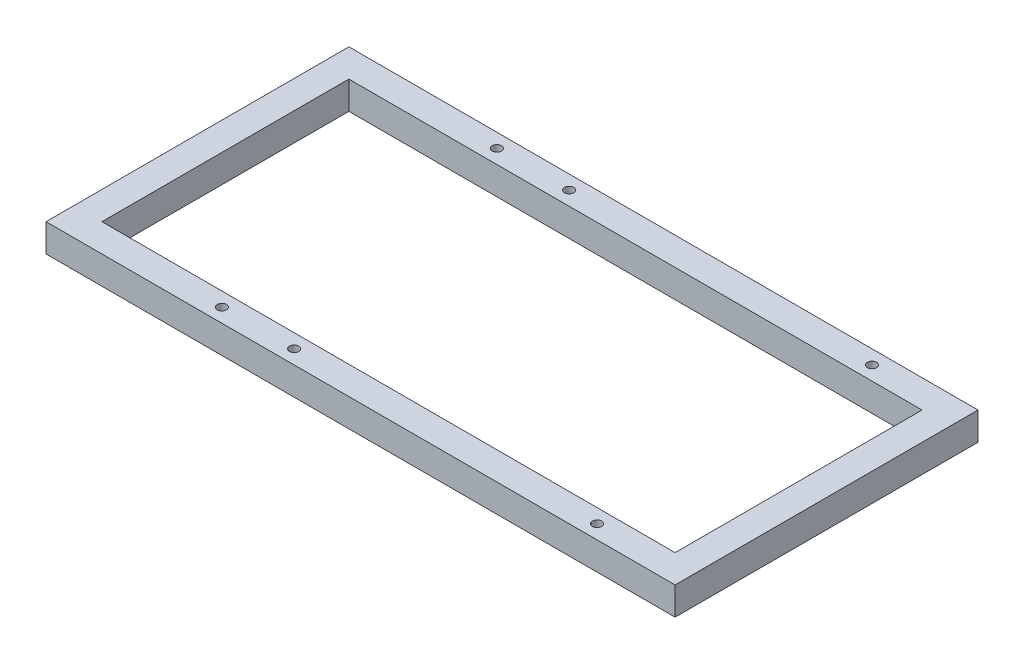
ISO-10303-21;
HEADER;
FILE_DESCRIPTION(('STEP AP214'),'2;1');
FILE_NAME('part.step','',(''),(''),'','','');
FILE_SCHEMA(('AUTOMOTIVE_DESIGN { 1 0 10303 214 1 1 1 1 }'));
ENDSEC;
DATA;
#1=APPLICATION_CONTEXT('core data for automotive mechanical design processes');
#2=APPLICATION_PROTOCOL_DEFINITION('international standard','automotive_design',2000,#1);
#3=PRODUCT_CONTEXT('',#1,'mechanical');
#4=PRODUCT('Part','Part','',(#3));
#5=PRODUCT_RELATED_PRODUCT_CATEGORY('part','',(#4));
#6=PRODUCT_DEFINITION_FORMATION('','',#4);
#7=PRODUCT_DEFINITION_CONTEXT('part definition',#1,'design');
#8=PRODUCT_DEFINITION('design','',#6,#7);
#9=PRODUCT_DEFINITION_SHAPE('','',#8);
#10=(LENGTH_UNIT() NAMED_UNIT(*) SI_UNIT(.MILLI.,.METRE.));
#11=(NAMED_UNIT(*) PLANE_ANGLE_UNIT() SI_UNIT($,.RADIAN.));
#12=(NAMED_UNIT(*) SI_UNIT($,.STERADIAN.) SOLID_ANGLE_UNIT());
#13=UNCERTAINTY_MEASURE_WITH_UNIT(LENGTH_MEASURE(1.E-05),#10,'distance_accuracy_value','');
#14=(GEOMETRIC_REPRESENTATION_CONTEXT(3) GLOBAL_UNCERTAINTY_ASSIGNED_CONTEXT((#13)) GLOBAL_UNIT_ASSIGNED_CONTEXT((#10,
#11,#12)) REPRESENTATION_CONTEXT('',''));
#15=CARTESIAN_POINT('',(0.,0.,0.));
#16=DIRECTION('',(0.,0.,1.));
#17=DIRECTION('',(1.,0.,0.));
#18=AXIS2_PLACEMENT_3D('',#15,#16,#17);
#19=CARTESIAN_POINT('',(0.,12.,0.));
#20=DIRECTION('',(0.,1.,0.));
#21=DIRECTION('',(0.,0.,1.));
#22=AXIS2_PLACEMENT_3D('',#19,#20,#21);
#23=PLANE('',#22);
#24=CARTESIAN_POINT('',(95.4999999999999,12.,-59.));
#25=DIRECTION('',(0.,-1.,0.));
#26=DIRECTION('',(0.,0.,-1.));
#27=AXIS2_PLACEMENT_3D('',#24,#25,#26);
#28=CIRCLE('',#27,2.);
#29=CARTESIAN_POINT('',(95.4999999999999,12.,-61.));
#30=VERTEX_POINT('',#29);
#31=EDGE_CURVE('E195',#30,#30,#28,.T.);
#32=ORIENTED_EDGE('',*,*,#31,.T.);
#33=EDGE_LOOP('',(#32));
#34=FACE_BOUND('',#33,.T.);
#35=CARTESIAN_POINT('',(95.4999999999999,12.,59.));
#36=DIRECTION('',(0.,1.,0.));
#37=DIRECTION('',(0.,0.,1.));
#38=AXIS2_PLACEMENT_3D('',#35,#36,#37);
#39=CIRCLE('',#38,2.);
#40=CARTESIAN_POINT('',(95.4999999999999,12.,61.));
#41=VERTEX_POINT('',#40);
#42=EDGE_CURVE('E185',#41,#41,#39,.T.);
#43=ORIENTED_EDGE('',*,*,#42,.F.);
#44=EDGE_LOOP('',(#43));
#45=FACE_BOUND('',#44,.T.);
#46=CARTESIAN_POINT('',(-34.5000000000001,12.,59.));
#47=DIRECTION('',(0.,1.,0.));
#48=DIRECTION('',(0.,0.,1.));
#49=AXIS2_PLACEMENT_3D('',#46,#47,#48);
#50=CIRCLE('',#49,2.);
#51=CARTESIAN_POINT('',(-34.5000000000001,12.,61.));
#52=VERTEX_POINT('',#51);
#53=EDGE_CURVE('E182',#52,#52,#50,.T.);
#54=ORIENTED_EDGE('',*,*,#53,.F.);
#55=EDGE_LOOP('',(#54));
#56=FACE_BOUND('',#55,.T.);
#57=CARTESIAN_POINT('',(-34.5000000000001,12.,-59.));
#58=DIRECTION('',(0.,-1.,0.));
#59=DIRECTION('',(0.,0.,-1.));
#60=AXIS2_PLACEMENT_3D('',#57,#58,#59);
#61=CIRCLE('',#60,2.);
#62=CARTESIAN_POINT('',(-34.5000000000001,12.,-61.));
#63=VERTEX_POINT('',#62);
#64=EDGE_CURVE('E179',#63,#63,#61,.T.);
#65=ORIENTED_EDGE('',*,*,#64,.T.);
#66=EDGE_LOOP('',(#65));
#67=FACE_BOUND('',#66,.T.);
#68=CARTESIAN_POINT('',(-65.5000000000001,12.,-59.));
#69=DIRECTION('',(0.,-1.,0.));
#70=DIRECTION('',(0.,0.,-1.));
#71=AXIS2_PLACEMENT_3D('',#68,#69,#70);
#72=CIRCLE('',#71,2.);
#73=CARTESIAN_POINT('',(-65.5000000000001,12.,-61.));
#74=VERTEX_POINT('',#73);
#75=EDGE_CURVE('E175',#74,#74,#72,.T.);
#76=ORIENTED_EDGE('',*,*,#75,.T.);
#77=EDGE_LOOP('',(#76));
#78=FACE_BOUND('',#77,.T.);
#79=CARTESIAN_POINT('',(-65.5000000000001,12.,59.));
#80=DIRECTION('',(0.,1.,0.));
#81=DIRECTION('',(0.,0.,1.));
#82=AXIS2_PLACEMENT_3D('',#79,#80,#81);
#83=CIRCLE('',#82,2.);
#84=CARTESIAN_POINT('',(-65.5000000000001,12.,61.));
#85=VERTEX_POINT('',#84);
#86=EDGE_CURVE('E171',#85,#85,#83,.T.);
#87=ORIENTED_EDGE('',*,*,#86,.F.);
#88=EDGE_LOOP('',(#87));
#89=FACE_BOUND('',#88,.T.);
#90=DIRECTION('',(0.,0.,-1.));
#91=VECTOR('',#90,1.);
#92=CARTESIAN_POINT('',(135.,12.,-65.));
#93=LINE('',#92,#91);
#94=CARTESIAN_POINT('',(135.,12.,65.));
#95=VERTEX_POINT('',#94);
#96=CARTESIAN_POINT('',(135.,12.,-65.));
#97=VERTEX_POINT('',#96);
#98=EDGE_CURVE('E144',#95,#97,#93,.T.);
#99=ORIENTED_EDGE('',*,*,#98,.T.);
#100=DIRECTION('',(-1.,0.,0.));
#101=VECTOR('',#100,1.);
#102=CARTESIAN_POINT('',(-135.,12.,-65.));
#103=LINE('',#102,#101);
#104=CARTESIAN_POINT('',(-135.,12.,-65.));
#105=VERTEX_POINT('',#104);
#106=EDGE_CURVE('E147',#97,#105,#103,.T.);
#107=ORIENTED_EDGE('',*,*,#106,.T.);
#108=DIRECTION('',(0.,0.,1.));
#109=VECTOR('',#108,1.);
#110=CARTESIAN_POINT('',(-135.,12.,-65.));
#111=LINE('',#110,#109);
#112=CARTESIAN_POINT('',(-135.,12.,65.));
#113=VERTEX_POINT('',#112);
#114=EDGE_CURVE('E150',#105,#113,#111,.T.);
#115=ORIENTED_EDGE('',*,*,#114,.T.);
#116=DIRECTION('',(1.,0.,0.));
#117=VECTOR('',#116,1.);
#118=CARTESIAN_POINT('',(-135.,12.,65.));
#119=LINE('',#118,#117);
#120=EDGE_CURVE('E152',#113,#95,#119,.T.);
#121=ORIENTED_EDGE('',*,*,#120,.T.);
#122=EDGE_LOOP('',(#99,#107,#115,#121));
#123=FACE_BOUND('',#122,.T.);
#124=DIRECTION('',(-1.,0.,0.));
#125=VECTOR('',#124,1.);
#126=CARTESIAN_POINT('',(-123.,12.,-53.));
#127=LINE('',#126,#125);
#128=CARTESIAN_POINT('',(123.,12.,-53.));
#129=VERTEX_POINT('',#128);
#130=CARTESIAN_POINT('',(-123.,12.,-53.));
#131=VERTEX_POINT('',#130);
#132=EDGE_CURVE('E114',#129,#131,#127,.T.);
#133=ORIENTED_EDGE('',*,*,#132,.F.);
#134=DIRECTION('',(0.,0.,-1.));
#135=VECTOR('',#134,1.);
#136=CARTESIAN_POINT('',(123.,12.,-53.));
#137=LINE('',#136,#135);
#138=CARTESIAN_POINT('',(123.,12.,53.));
#139=VERTEX_POINT('',#138);
#140=EDGE_CURVE('E106',#139,#129,#137,.T.);
#141=ORIENTED_EDGE('',*,*,#140,.F.);
#142=DIRECTION('',(1.,0.,0.));
#143=VECTOR('',#142,1.);
#144=CARTESIAN_POINT('',(-123.,12.,53.));
#145=LINE('',#144,#143);
#146=CARTESIAN_POINT('',(-123.,12.,53.));
#147=VERTEX_POINT('',#146);
#148=EDGE_CURVE('E128',#147,#139,#145,.T.);
#149=ORIENTED_EDGE('',*,*,#148,.F.);
#150=DIRECTION('',(0.,0.,1.));
#151=VECTOR('',#150,1.);
#152=CARTESIAN_POINT('',(-123.,12.,-53.));
#153=LINE('',#152,#151);
#154=EDGE_CURVE('E126',#131,#147,#153,.T.);
#155=ORIENTED_EDGE('',*,*,#154,.F.);
#156=EDGE_LOOP('',(#133,#141,#149,#155));
#157=FACE_BOUND('',#156,.T.);
#158=ADVANCED_FACE('F39',(#34,#45,#56,#67,#78,#89,#123,#157),#23,.T.);
#159=CARTESIAN_POINT('',(0.,0.,0.));
#160=DIRECTION('',(0.,1.,0.));
#161=DIRECTION('',(0.,0.,1.));
#162=AXIS2_PLACEMENT_3D('',#159,#160,#161);
#163=PLANE('',#162);
#164=CARTESIAN_POINT('',(95.4999999999999,0.,-59.));
#165=DIRECTION('',(0.,1.,0.));
#166=DIRECTION('',(0.,0.,1.));
#167=AXIS2_PLACEMENT_3D('',#164,#165,#166);
#168=CIRCLE('',#167,2.);
#169=CARTESIAN_POINT('',(95.4999999999999,0.,-57.));
#170=VERTEX_POINT('',#169);
#171=EDGE_CURVE('E43',#170,#170,#168,.F.);
#172=ORIENTED_EDGE('',*,*,#171,.F.);
#173=EDGE_LOOP('',(#172));
#174=FACE_BOUND('',#173,.T.);
#175=CARTESIAN_POINT('',(95.4999999999999,0.,59.));
#176=DIRECTION('',(0.,1.,0.));
#177=DIRECTION('',(0.,0.,1.));
#178=AXIS2_PLACEMENT_3D('',#175,#176,#177);
#179=CIRCLE('',#178,2.);
#180=CARTESIAN_POINT('',(95.4999999999999,0.,61.));
#181=VERTEX_POINT('',#180);
#182=EDGE_CURVE('E183',#181,#181,#179,.T.);
#183=ORIENTED_EDGE('',*,*,#182,.T.);
#184=EDGE_LOOP('',(#183));
#185=FACE_BOUND('',#184,.T.);
#186=CARTESIAN_POINT('',(-34.5000000000001,0.,59.));
#187=DIRECTION('',(0.,1.,0.));
#188=DIRECTION('',(0.,0.,1.));
#189=AXIS2_PLACEMENT_3D('',#186,#187,#188);
#190=CIRCLE('',#189,2.);
#191=CARTESIAN_POINT('',(-34.5000000000001,0.,61.));
#192=VERTEX_POINT('',#191);
#193=EDGE_CURVE('E180',#192,#192,#190,.T.);
#194=ORIENTED_EDGE('',*,*,#193,.T.);
#195=EDGE_LOOP('',(#194));
#196=FACE_BOUND('',#195,.T.);
#197=CARTESIAN_POINT('',(-34.5000000000001,0.,-59.));
#198=DIRECTION('',(0.,1.,0.));
#199=DIRECTION('',(0.,0.,1.));
#200=AXIS2_PLACEMENT_3D('',#197,#198,#199);
#201=CIRCLE('',#200,2.);
#202=CARTESIAN_POINT('',(-34.5000000000001,0.,-57.));
#203=VERTEX_POINT('',#202);
#204=EDGE_CURVE('E176',#203,#203,#201,.F.);
#205=ORIENTED_EDGE('',*,*,#204,.F.);
#206=EDGE_LOOP('',(#205));
#207=FACE_BOUND('',#206,.T.);
#208=CARTESIAN_POINT('',(-65.5000000000001,0.,-59.));
#209=DIRECTION('',(0.,1.,0.));
#210=DIRECTION('',(0.,0.,1.));
#211=AXIS2_PLACEMENT_3D('',#208,#209,#210);
#212=CIRCLE('',#211,2.);
#213=CARTESIAN_POINT('',(-65.5000000000001,0.,-57.));
#214=VERTEX_POINT('',#213);
#215=EDGE_CURVE('E172',#214,#214,#212,.F.);
#216=ORIENTED_EDGE('',*,*,#215,.F.);
#217=EDGE_LOOP('',(#216));
#218=FACE_BOUND('',#217,.T.);
#219=CARTESIAN_POINT('',(-65.5000000000001,0.,59.));
#220=DIRECTION('',(0.,1.,0.));
#221=DIRECTION('',(0.,0.,1.));
#222=AXIS2_PLACEMENT_3D('',#219,#220,#221);
#223=CIRCLE('',#222,2.);
#224=CARTESIAN_POINT('',(-65.5000000000001,0.,61.));
#225=VERTEX_POINT('',#224);
#226=EDGE_CURVE('E134',#225,#225,#223,.T.);
#227=ORIENTED_EDGE('',*,*,#226,.T.);
#228=EDGE_LOOP('',(#227));
#229=FACE_BOUND('',#228,.T.);
#230=DIRECTION('',(0.,0.,-1.));
#231=VECTOR('',#230,1.);
#232=CARTESIAN_POINT('',(135.,0.,-65.));
#233=LINE('',#232,#231);
#234=CARTESIAN_POINT('',(135.,0.,65.));
#235=VERTEX_POINT('',#234);
#236=CARTESIAN_POINT('',(135.,0.,-65.));
#237=VERTEX_POINT('',#236);
#238=EDGE_CURVE('E122',#235,#237,#233,.T.);
#239=ORIENTED_EDGE('',*,*,#238,.F.);
#240=DIRECTION('',(1.,0.,0.));
#241=VECTOR('',#240,1.);
#242=CARTESIAN_POINT('',(-135.,0.,65.));
#243=LINE('',#242,#241);
#244=CARTESIAN_POINT('',(-135.,0.,65.));
#245=VERTEX_POINT('',#244);
#246=EDGE_CURVE('E148',#245,#235,#243,.T.);
#247=ORIENTED_EDGE('',*,*,#246,.F.);
#248=DIRECTION('',(0.,0.,1.));
#249=VECTOR('',#248,1.);
#250=CARTESIAN_POINT('',(-135.,0.,-65.));
#251=LINE('',#250,#249);
#252=CARTESIAN_POINT('',(-135.,0.,-65.));
#253=VERTEX_POINT('',#252);
#254=EDGE_CURVE('E159',#253,#245,#251,.T.);
#255=ORIENTED_EDGE('',*,*,#254,.F.);
#256=DIRECTION('',(-1.,0.,0.));
#257=VECTOR('',#256,1.);
#258=CARTESIAN_POINT('',(-135.,0.,-65.));
#259=LINE('',#258,#257);
#260=EDGE_CURVE('E157',#237,#253,#259,.T.);
#261=ORIENTED_EDGE('',*,*,#260,.F.);
#262=EDGE_LOOP('',(#239,#247,#255,#261));
#263=FACE_BOUND('',#262,.T.);
#264=DIRECTION('',(0.,0.,-1.));
#265=VECTOR('',#264,1.);
#266=CARTESIAN_POINT('',(123.,0.,-53.));
#267=LINE('',#266,#265);
#268=CARTESIAN_POINT('',(123.,0.,53.));
#269=VERTEX_POINT('',#268);
#270=CARTESIAN_POINT('',(123.,0.,-53.));
#271=VERTEX_POINT('',#270);
#272=EDGE_CURVE('E64',#269,#271,#267,.T.);
#273=ORIENTED_EDGE('',*,*,#272,.T.);
#274=DIRECTION('',(-1.,0.,0.));
#275=VECTOR('',#274,1.);
#276=CARTESIAN_POINT('',(-123.,0.,-53.));
#277=LINE('',#276,#275);
#278=CARTESIAN_POINT('',(-123.,0.,-53.));
#279=VERTEX_POINT('',#278);
#280=EDGE_CURVE('E121',#271,#279,#277,.T.);
#281=ORIENTED_EDGE('',*,*,#280,.T.);
#282=DIRECTION('',(0.,0.,1.));
#283=VECTOR('',#282,1.);
#284=CARTESIAN_POINT('',(-123.,0.,-53.));
#285=LINE('',#284,#283);
#286=CARTESIAN_POINT('',(-123.,0.,53.));
#287=VERTEX_POINT('',#286);
#288=EDGE_CURVE('E136',#279,#287,#285,.T.);
#289=ORIENTED_EDGE('',*,*,#288,.T.);
#290=DIRECTION('',(1.,0.,0.));
#291=VECTOR('',#290,1.);
#292=CARTESIAN_POINT('',(-123.,0.,53.));
#293=LINE('',#292,#291);
#294=EDGE_CURVE('E115',#287,#269,#293,.T.);
#295=ORIENTED_EDGE('',*,*,#294,.T.);
#296=EDGE_LOOP('',(#273,#281,#289,#295));
#297=FACE_BOUND('',#296,.T.);
#298=ADVANCED_FACE('F209',(#174,#185,#196,#207,#218,#229,#263,#297),#163,.F.);
#299=CARTESIAN_POINT('',(135.,12.,-65.));
#300=DIRECTION('',(-1.,0.,0.));
#301=DIRECTION('',(0.,0.,1.));
#302=AXIS2_PLACEMENT_3D('',#299,#300,#301);
#303=PLANE('',#302);
#304=ORIENTED_EDGE('',*,*,#238,.T.);
#305=DIRECTION('',(0.,-1.,0.));
#306=VECTOR('',#305,1.);
#307=CARTESIAN_POINT('',(135.,12.,-65.));
#308=LINE('',#307,#306);
#309=EDGE_CURVE('E11',#97,#237,#308,.T.);
#310=ORIENTED_EDGE('',*,*,#309,.F.);
#311=ORIENTED_EDGE('',*,*,#98,.F.);
#312=DIRECTION('',(0.,-1.,0.));
#313=VECTOR('',#312,1.);
#314=CARTESIAN_POINT('',(135.,12.,65.));
#315=LINE('',#314,#313);
#316=EDGE_CURVE('E154',#95,#235,#315,.T.);
#317=ORIENTED_EDGE('',*,*,#316,.T.);
#318=EDGE_LOOP('',(#304,#310,#311,#317));
#319=FACE_BOUND('',#318,.T.);
#320=ADVANCED_FACE('F41',(#319),#303,.F.);
#321=CARTESIAN_POINT('',(-135.,12.,-65.));
#322=DIRECTION('',(0.,0.,1.));
#323=DIRECTION('',(1.,0.,0.));
#324=AXIS2_PLACEMENT_3D('',#321,#322,#323);
#325=PLANE('',#324);
#326=ORIENTED_EDGE('',*,*,#260,.T.);
#327=DIRECTION('',(0.,-1.,0.));
#328=VECTOR('',#327,1.);
#329=CARTESIAN_POINT('',(-135.,12.,-65.));
#330=LINE('',#329,#328);
#331=EDGE_CURVE('E48',#105,#253,#330,.T.);
#332=ORIENTED_EDGE('',*,*,#331,.F.);
#333=ORIENTED_EDGE('',*,*,#106,.F.);
#334=ORIENTED_EDGE('',*,*,#309,.T.);
#335=EDGE_LOOP('',(#326,#332,#333,#334));
#336=FACE_BOUND('',#335,.T.);
#337=ADVANCED_FACE('F220',(#336),#325,.F.);
#338=CARTESIAN_POINT('',(-135.,12.,-65.));
#339=DIRECTION('',(1.,0.,0.));
#340=DIRECTION('',(0.,0.,-1.));
#341=AXIS2_PLACEMENT_3D('',#338,#339,#340);
#342=PLANE('',#341);
#343=ORIENTED_EDGE('',*,*,#254,.T.);
#344=DIRECTION('',(0.,-1.,0.));
#345=VECTOR('',#344,1.);
#346=CARTESIAN_POINT('',(-135.,12.,65.));
#347=LINE('',#346,#345);
#348=EDGE_CURVE('E164',#113,#245,#347,.T.);
#349=ORIENTED_EDGE('',*,*,#348,.F.);
#350=ORIENTED_EDGE('',*,*,#114,.F.);
#351=ORIENTED_EDGE('',*,*,#331,.T.);
#352=EDGE_LOOP('',(#343,#349,#350,#351));
#353=FACE_BOUND('',#352,.T.);
#354=ADVANCED_FACE('F225',(#353),#342,.F.);
#355=CARTESIAN_POINT('',(-135.,12.,65.));
#356=DIRECTION('',(0.,0.,-1.));
#357=DIRECTION('',(-1.,0.,0.));
#358=AXIS2_PLACEMENT_3D('',#355,#356,#357);
#359=PLANE('',#358);
#360=ORIENTED_EDGE('',*,*,#246,.T.);
#361=ORIENTED_EDGE('',*,*,#316,.F.);
#362=ORIENTED_EDGE('',*,*,#120,.F.);
#363=ORIENTED_EDGE('',*,*,#348,.T.);
#364=EDGE_LOOP('',(#360,#361,#362,#363));
#365=FACE_BOUND('',#364,.T.);
#366=ADVANCED_FACE('F228',(#365),#359,.F.);
#367=CARTESIAN_POINT('',(123.,12.,-53.));
#368=DIRECTION('',(-1.,0.,0.));
#369=DIRECTION('',(0.,0.,1.));
#370=AXIS2_PLACEMENT_3D('',#367,#368,#369);
#371=PLANE('',#370);
#372=ORIENTED_EDGE('',*,*,#272,.F.);
#373=DIRECTION('',(0.,-1.,0.));
#374=VECTOR('',#373,1.);
#375=CARTESIAN_POINT('',(123.,12.,53.));
#376=LINE('',#375,#374);
#377=EDGE_CURVE('E110',#139,#269,#376,.T.);
#378=ORIENTED_EDGE('',*,*,#377,.F.);
#379=ORIENTED_EDGE('',*,*,#140,.T.);
#380=DIRECTION('',(0.,-1.,0.));
#381=VECTOR('',#380,1.);
#382=CARTESIAN_POINT('',(123.,12.,-53.));
#383=LINE('',#382,#381);
#384=EDGE_CURVE('E109',#129,#271,#383,.T.);
#385=ORIENTED_EDGE('',*,*,#384,.T.);
#386=EDGE_LOOP('',(#372,#378,#379,#385));
#387=FACE_BOUND('',#386,.T.);
#388=ADVANCED_FACE('F108',(#387),#371,.T.);
#389=CARTESIAN_POINT('',(-123.,12.,-53.));
#390=DIRECTION('',(0.,0.,1.));
#391=DIRECTION('',(1.,0.,0.));
#392=AXIS2_PLACEMENT_3D('',#389,#390,#391);
#393=PLANE('',#392);
#394=ORIENTED_EDGE('',*,*,#280,.F.);
#395=ORIENTED_EDGE('',*,*,#384,.F.);
#396=ORIENTED_EDGE('',*,*,#132,.T.);
#397=DIRECTION('',(0.,-1.,0.));
#398=VECTOR('',#397,1.);
#399=CARTESIAN_POINT('',(-123.,12.,-53.));
#400=LINE('',#399,#398);
#401=EDGE_CURVE('E123',#131,#279,#400,.T.);
#402=ORIENTED_EDGE('',*,*,#401,.T.);
#403=EDGE_LOOP('',(#394,#395,#396,#402));
#404=FACE_BOUND('',#403,.T.);
#405=ADVANCED_FACE('F118',(#404),#393,.T.);
#406=CARTESIAN_POINT('',(-123.,12.,-53.));
#407=DIRECTION('',(1.,0.,0.));
#408=DIRECTION('',(0.,0.,-1.));
#409=AXIS2_PLACEMENT_3D('',#406,#407,#408);
#410=PLANE('',#409);
#411=ORIENTED_EDGE('',*,*,#288,.F.);
#412=ORIENTED_EDGE('',*,*,#401,.F.);
#413=ORIENTED_EDGE('',*,*,#154,.T.);
#414=DIRECTION('',(0.,-1.,0.));
#415=VECTOR('',#414,1.);
#416=CARTESIAN_POINT('',(-123.,12.,53.));
#417=LINE('',#416,#415);
#418=EDGE_CURVE('E56',#147,#287,#417,.T.);
#419=ORIENTED_EDGE('',*,*,#418,.T.);
#420=EDGE_LOOP('',(#411,#412,#413,#419));
#421=FACE_BOUND('',#420,.T.);
#422=ADVANCED_FACE('F237',(#421),#410,.T.);
#423=CARTESIAN_POINT('',(-123.,12.,53.));
#424=DIRECTION('',(0.,0.,-1.));
#425=DIRECTION('',(-1.,0.,0.));
#426=AXIS2_PLACEMENT_3D('',#423,#424,#425);
#427=PLANE('',#426);
#428=ORIENTED_EDGE('',*,*,#294,.F.);
#429=ORIENTED_EDGE('',*,*,#418,.F.);
#430=ORIENTED_EDGE('',*,*,#148,.T.);
#431=ORIENTED_EDGE('',*,*,#377,.T.);
#432=EDGE_LOOP('',(#428,#429,#430,#431));
#433=FACE_BOUND('',#432,.T.);
#434=ADVANCED_FACE('F235',(#433),#427,.T.);
#435=CARTESIAN_POINT('',(-65.5000000000001,-38.25,59.));
#436=DIRECTION('',(0.,1.,0.));
#437=DIRECTION('',(0.,0.,1.));
#438=AXIS2_PLACEMENT_3D('',#435,#436,#437);
#439=CYLINDRICAL_SURFACE('',#438,2.);
#440=ORIENTED_EDGE('',*,*,#86,.T.);
#441=EDGE_LOOP('',(#440));
#442=FACE_BOUND('',#441,.T.);
#443=ORIENTED_EDGE('',*,*,#226,.F.);
#444=EDGE_LOOP('',(#443));
#445=FACE_BOUND('',#444,.T.);
#446=ADVANCED_FACE('F204',(#442,#445),#439,.F.);
#447=CARTESIAN_POINT('',(-65.5000000000001,-38.25,-59.));
#448=DIRECTION('',(0.,1.,0.));
#449=DIRECTION('',(0.,0.,1.));
#450=AXIS2_PLACEMENT_3D('',#447,#448,#449);
#451=CYLINDRICAL_SURFACE('',#450,2.);
#452=ORIENTED_EDGE('',*,*,#75,.F.);
#453=EDGE_LOOP('',(#452));
#454=FACE_BOUND('',#453,.T.);
#455=ORIENTED_EDGE('',*,*,#215,.T.);
#456=EDGE_LOOP('',(#455));
#457=FACE_BOUND('',#456,.T.);
#458=ADVANCED_FACE('F243',(#454,#457),#451,.F.);
#459=CARTESIAN_POINT('',(-34.5000000000001,-38.25,-59.));
#460=DIRECTION('',(0.,1.,0.));
#461=DIRECTION('',(0.,0.,1.));
#462=AXIS2_PLACEMENT_3D('',#459,#460,#461);
#463=CYLINDRICAL_SURFACE('',#462,2.);
#464=ORIENTED_EDGE('',*,*,#64,.F.);
#465=EDGE_LOOP('',(#464));
#466=FACE_BOUND('',#465,.T.);
#467=ORIENTED_EDGE('',*,*,#204,.T.);
#468=EDGE_LOOP('',(#467));
#469=FACE_BOUND('',#468,.T.);
#470=ADVANCED_FACE('F293',(#466,#469),#463,.F.);
#471=CARTESIAN_POINT('',(-34.5000000000001,-38.25,59.));
#472=DIRECTION('',(0.,1.,0.));
#473=DIRECTION('',(0.,0.,1.));
#474=AXIS2_PLACEMENT_3D('',#471,#472,#473);
#475=CYLINDRICAL_SURFACE('',#474,2.);
#476=ORIENTED_EDGE('',*,*,#53,.T.);
#477=EDGE_LOOP('',(#476));
#478=FACE_BOUND('',#477,.T.);
#479=ORIENTED_EDGE('',*,*,#193,.F.);
#480=EDGE_LOOP('',(#479));
#481=FACE_BOUND('',#480,.T.);
#482=ADVANCED_FACE('F282',(#478,#481),#475,.F.);
#483=CARTESIAN_POINT('',(95.4999999999999,-38.25,59.));
#484=DIRECTION('',(0.,1.,0.));
#485=DIRECTION('',(0.,0.,1.));
#486=AXIS2_PLACEMENT_3D('',#483,#484,#485);
#487=CYLINDRICAL_SURFACE('',#486,2.);
#488=ORIENTED_EDGE('',*,*,#42,.T.);
#489=EDGE_LOOP('',(#488));
#490=FACE_BOUND('',#489,.T.);
#491=ORIENTED_EDGE('',*,*,#182,.F.);
#492=EDGE_LOOP('',(#491));
#493=FACE_BOUND('',#492,.T.);
#494=ADVANCED_FACE('F276',(#490,#493),#487,.F.);
#495=CARTESIAN_POINT('',(95.4999999999999,-38.25,-59.));
#496=DIRECTION('',(0.,1.,0.));
#497=DIRECTION('',(0.,0.,1.));
#498=AXIS2_PLACEMENT_3D('',#495,#496,#497);
#499=CYLINDRICAL_SURFACE('',#498,2.);
#500=ORIENTED_EDGE('',*,*,#31,.F.);
#501=EDGE_LOOP('',(#500));
#502=FACE_BOUND('',#501,.T.);
#503=ORIENTED_EDGE('',*,*,#171,.T.);
#504=EDGE_LOOP('',(#503));
#505=FACE_BOUND('',#504,.T.);
#506=ADVANCED_FACE('F281',(#502,#505),#499,.F.);
#507=CLOSED_SHELL('',(#158,#298,#320,#337,#354,#366,#388,#405,#422,#434,#446,#458,#470,#482,
#494,#506));
#508=MANIFOLD_SOLID_BREP('B2',#507);
#509=ADVANCED_BREP_SHAPE_REPRESENTATION('',(#18,#508),#14);
#510=SHAPE_DEFINITION_REPRESENTATION(#9,#509);
ENDSEC;
END-ISO-10303-21;
